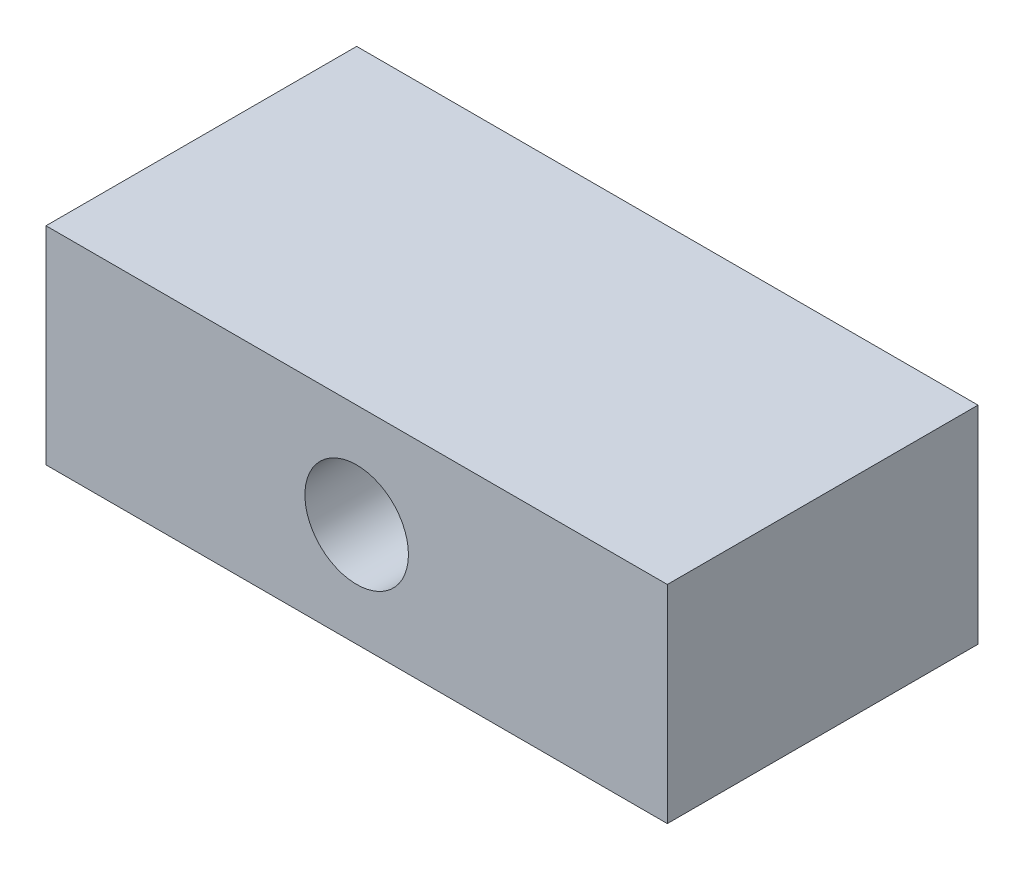
ISO-10303-21;
HEADER;
FILE_DESCRIPTION(('STEP AP214'),'2;1');
FILE_NAME('part.step','',(''),(''),'','','');
FILE_SCHEMA(('AUTOMOTIVE_DESIGN { 1 0 10303 214 1 1 1 1 }'));
ENDSEC;
DATA;
#1=APPLICATION_CONTEXT('core data for automotive mechanical design processes');
#2=APPLICATION_PROTOCOL_DEFINITION('international standard','automotive_design',2000,#1);
#3=PRODUCT_CONTEXT('',#1,'mechanical');
#4=PRODUCT('Part','Part','',(#3));
#5=PRODUCT_RELATED_PRODUCT_CATEGORY('part','',(#4));
#6=PRODUCT_DEFINITION_FORMATION('','',#4);
#7=PRODUCT_DEFINITION_CONTEXT('part definition',#1,'design');
#8=PRODUCT_DEFINITION('design','',#6,#7);
#9=PRODUCT_DEFINITION_SHAPE('','',#8);
#10=(LENGTH_UNIT() NAMED_UNIT(*) SI_UNIT(.MILLI.,.METRE.));
#11=(NAMED_UNIT(*) PLANE_ANGLE_UNIT() SI_UNIT($,.RADIAN.));
#12=(NAMED_UNIT(*) SI_UNIT($,.STERADIAN.) SOLID_ANGLE_UNIT());
#13=UNCERTAINTY_MEASURE_WITH_UNIT(LENGTH_MEASURE(1.E-05),#10,'distance_accuracy_value','');
#14=(GEOMETRIC_REPRESENTATION_CONTEXT(3) GLOBAL_UNCERTAINTY_ASSIGNED_CONTEXT((#13)) GLOBAL_UNIT_ASSIGNED_CONTEXT((#10,
#11,#12)) REPRESENTATION_CONTEXT('',''));
#15=CARTESIAN_POINT('',(0.,0.,0.));
#16=DIRECTION('',(0.,0.,1.));
#17=DIRECTION('',(1.,0.,0.));
#18=AXIS2_PLACEMENT_3D('',#15,#16,#17);
#19=CARTESIAN_POINT('',(150.,50.,75.));
#20=DIRECTION('',(-1.,0.,0.));
#21=DIRECTION('',(0.,0.,1.));
#22=AXIS2_PLACEMENT_3D('',#19,#20,#21);
#23=PLANE('',#22);
#24=DIRECTION('',(0.,0.,-1.));
#25=VECTOR('',#24,1.);
#26=CARTESIAN_POINT('',(150.,-50.,75.));
#27=LINE('',#26,#25);
#28=CARTESIAN_POINT('',(150.,-50.,75.));
#29=VERTEX_POINT('',#28);
#30=CARTESIAN_POINT('',(150.,-50.,-75.));
#31=VERTEX_POINT('',#30);
#32=EDGE_CURVE('E99',#29,#31,#27,.T.);
#33=ORIENTED_EDGE('',*,*,#32,.T.);
#34=DIRECTION('',(0.,-1.,0.));
#35=VECTOR('',#34,1.);
#36=CARTESIAN_POINT('',(150.,50.,-75.));
#37=LINE('',#36,#35);
#38=CARTESIAN_POINT('',(150.,50.,-75.));
#39=VERTEX_POINT('',#38);
#40=EDGE_CURVE('E11',#39,#31,#37,.T.);
#41=ORIENTED_EDGE('',*,*,#40,.F.);
#42=DIRECTION('',(0.,0.,-1.));
#43=VECTOR('',#42,1.);
#44=CARTESIAN_POINT('',(150.,50.,75.));
#45=LINE('',#44,#43);
#46=CARTESIAN_POINT('',(150.,50.,75.));
#47=VERTEX_POINT('',#46);
#48=EDGE_CURVE('E87',#47,#39,#45,.T.);
#49=ORIENTED_EDGE('',*,*,#48,.F.);
#50=DIRECTION('',(0.,-1.,0.));
#51=VECTOR('',#50,1.);
#52=CARTESIAN_POINT('',(150.,50.,75.));
#53=LINE('',#52,#51);
#54=EDGE_CURVE('E95',#47,#29,#53,.T.);
#55=ORIENTED_EDGE('',*,*,#54,.T.);
#56=EDGE_LOOP('',(#33,#41,#49,#55));
#57=FACE_BOUND('',#56,.T.);
#58=ADVANCED_FACE('F36',(#57),#23,.F.);
#59=CARTESIAN_POINT('',(-150.,50.,-75.));
#60=DIRECTION('',(0.,0.,1.));
#61=DIRECTION('',(1.,0.,0.));
#62=AXIS2_PLACEMENT_3D('',#59,#60,#61);
#63=PLANE('',#62);
#64=CARTESIAN_POINT('',(0.,0.,-75.));
#65=DIRECTION('',(0.,0.,1.));
#66=DIRECTION('',(1.,0.,0.));
#67=AXIS2_PLACEMENT_3D('',#64,#65,#66);
#68=CIRCLE('',#67,25.);
#69=CARTESIAN_POINT('',(25.,0.,-75.));
#70=VERTEX_POINT('',#69);
#71=EDGE_CURVE('E102',#70,#70,#68,.T.);
#72=ORIENTED_EDGE('',*,*,#71,.T.);
#73=EDGE_LOOP('',(#72));
#74=FACE_BOUND('',#73,.T.);
#75=DIRECTION('',(-1.,0.,0.));
#76=VECTOR('',#75,1.);
#77=CARTESIAN_POINT('',(-150.,-50.,-75.));
#78=LINE('',#77,#76);
#79=CARTESIAN_POINT('',(-150.,-50.,-75.));
#80=VERTEX_POINT('',#79);
#81=EDGE_CURVE('E91',#31,#80,#78,.T.);
#82=ORIENTED_EDGE('',*,*,#81,.T.);
#83=DIRECTION('',(0.,-1.,0.));
#84=VECTOR('',#83,1.);
#85=CARTESIAN_POINT('',(-150.,50.,-75.));
#86=LINE('',#85,#84);
#87=CARTESIAN_POINT('',(-150.,50.,-75.));
#88=VERTEX_POINT('',#87);
#89=EDGE_CURVE('E44',#88,#80,#86,.T.);
#90=ORIENTED_EDGE('',*,*,#89,.F.);
#91=DIRECTION('',(-1.,0.,0.));
#92=VECTOR('',#91,1.);
#93=CARTESIAN_POINT('',(-150.,50.,-75.));
#94=LINE('',#93,#92);
#95=EDGE_CURVE('E82',#39,#88,#94,.T.);
#96=ORIENTED_EDGE('',*,*,#95,.F.);
#97=ORIENTED_EDGE('',*,*,#40,.T.);
#98=EDGE_LOOP('',(#82,#90,#96,#97));
#99=FACE_BOUND('',#98,.T.);
#100=ADVANCED_FACE('F90',(#74,#99),#63,.F.);
#101=CARTESIAN_POINT('',(-150.,50.,75.));
#102=DIRECTION('',(1.,0.,0.));
#103=DIRECTION('',(0.,0.,-1.));
#104=AXIS2_PLACEMENT_3D('',#101,#102,#103);
#105=PLANE('',#104);
#106=DIRECTION('',(0.,0.,1.));
#107=VECTOR('',#106,1.);
#108=CARTESIAN_POINT('',(-150.,-50.,75.));
#109=LINE('',#108,#107);
#110=CARTESIAN_POINT('',(-150.,-50.,75.));
#111=VERTEX_POINT('',#110);
#112=EDGE_CURVE('E69',#80,#111,#109,.T.);
#113=ORIENTED_EDGE('',*,*,#112,.T.);
#114=DIRECTION('',(0.,-1.,0.));
#115=VECTOR('',#114,1.);
#116=CARTESIAN_POINT('',(-150.,50.,75.));
#117=LINE('',#116,#115);
#118=CARTESIAN_POINT('',(-150.,50.,75.));
#119=VERTEX_POINT('',#118);
#120=EDGE_CURVE('E92',#119,#111,#117,.T.);
#121=ORIENTED_EDGE('',*,*,#120,.F.);
#122=DIRECTION('',(0.,0.,1.));
#123=VECTOR('',#122,1.);
#124=CARTESIAN_POINT('',(-150.,50.,75.));
#125=LINE('',#124,#123);
#126=EDGE_CURVE('E85',#88,#119,#125,.T.);
#127=ORIENTED_EDGE('',*,*,#126,.F.);
#128=ORIENTED_EDGE('',*,*,#89,.T.);
#129=EDGE_LOOP('',(#113,#121,#127,#128));
#130=FACE_BOUND('',#129,.T.);
#131=ADVANCED_FACE('F93',(#130),#105,.F.);
#132=CARTESIAN_POINT('',(-150.,50.,75.));
#133=DIRECTION('',(0.,0.,-1.));
#134=DIRECTION('',(-1.,0.,0.));
#135=AXIS2_PLACEMENT_3D('',#132,#133,#134);
#136=PLANE('',#135);
#137=CARTESIAN_POINT('',(0.,0.,75.));
#138=DIRECTION('',(0.,0.,1.));
#139=DIRECTION('',(1.,0.,0.));
#140=AXIS2_PLACEMENT_3D('',#137,#138,#139);
#141=CIRCLE('',#140,25.);
#142=CARTESIAN_POINT('',(25.,0.,75.));
#143=VERTEX_POINT('',#142);
#144=EDGE_CURVE('E113',#143,#143,#141,.T.);
#145=ORIENTED_EDGE('',*,*,#144,.F.);
#146=EDGE_LOOP('',(#145));
#147=FACE_BOUND('',#146,.T.);
#148=DIRECTION('',(1.,0.,0.));
#149=VECTOR('',#148,1.);
#150=CARTESIAN_POINT('',(-150.,-50.,75.));
#151=LINE('',#150,#149);
#152=EDGE_CURVE('E75',#111,#29,#151,.T.);
#153=ORIENTED_EDGE('',*,*,#152,.T.);
#154=ORIENTED_EDGE('',*,*,#54,.F.);
#155=DIRECTION('',(1.,0.,0.));
#156=VECTOR('',#155,1.);
#157=CARTESIAN_POINT('',(-150.,50.,75.));
#158=LINE('',#157,#156);
#159=EDGE_CURVE('E52',#119,#47,#158,.T.);
#160=ORIENTED_EDGE('',*,*,#159,.F.);
#161=ORIENTED_EDGE('',*,*,#120,.T.);
#162=EDGE_LOOP('',(#153,#154,#160,#161));
#163=FACE_BOUND('',#162,.T.);
#164=ADVANCED_FACE('F107',(#147,#163),#136,.F.);
#165=CARTESIAN_POINT('',(0.,50.,0.));
#166=DIRECTION('',(0.,-1.,0.));
#167=DIRECTION('',(0.,0.,-1.));
#168=AXIS2_PLACEMENT_3D('',#165,#166,#167);
#169=PLANE('',#168);
#170=ORIENTED_EDGE('',*,*,#48,.T.);
#171=ORIENTED_EDGE('',*,*,#95,.T.);
#172=ORIENTED_EDGE('',*,*,#126,.T.);
#173=ORIENTED_EDGE('',*,*,#159,.T.);
#174=EDGE_LOOP('',(#170,#171,#172,#173));
#175=FACE_BOUND('',#174,.T.);
#176=ADVANCED_FACE('F83',(#175),#169,.F.);
#177=CARTESIAN_POINT('',(0.,-50.,0.));
#178=DIRECTION('',(0.,-1.,0.));
#179=DIRECTION('',(0.,0.,-1.));
#180=AXIS2_PLACEMENT_3D('',#177,#178,#179);
#181=PLANE('',#180);
#182=ORIENTED_EDGE('',*,*,#32,.F.);
#183=ORIENTED_EDGE('',*,*,#152,.F.);
#184=ORIENTED_EDGE('',*,*,#112,.F.);
#185=ORIENTED_EDGE('',*,*,#81,.F.);
#186=EDGE_LOOP('',(#182,#183,#184,#185));
#187=FACE_BOUND('',#186,.T.);
#188=ADVANCED_FACE('F110',(#187),#181,.T.);
#189=CARTESIAN_POINT('',(0.,0.,-75.));
#190=DIRECTION('',(0.,0.,1.));
#191=DIRECTION('',(1.,0.,0.));
#192=AXIS2_PLACEMENT_3D('',#189,#190,#191);
#193=CYLINDRICAL_SURFACE('',#192,25.);
#194=ORIENTED_EDGE('',*,*,#71,.F.);
#195=EDGE_LOOP('',(#194));
#196=FACE_BOUND('',#195,.T.);
#197=ORIENTED_EDGE('',*,*,#144,.T.);
#198=EDGE_LOOP('',(#197));
#199=FACE_BOUND('',#198,.T.);
#200=ADVANCED_FACE('F120',(#196,#199),#193,.F.);
#201=CLOSED_SHELL('',(#58,#100,#131,#164,#176,#188,#200));
#202=MANIFOLD_SOLID_BREP('B2',#201);
#203=ADVANCED_BREP_SHAPE_REPRESENTATION('',(#18,#202),#14);
#204=SHAPE_DEFINITION_REPRESENTATION(#9,#203);
ENDSEC;
END-ISO-10303-21;
